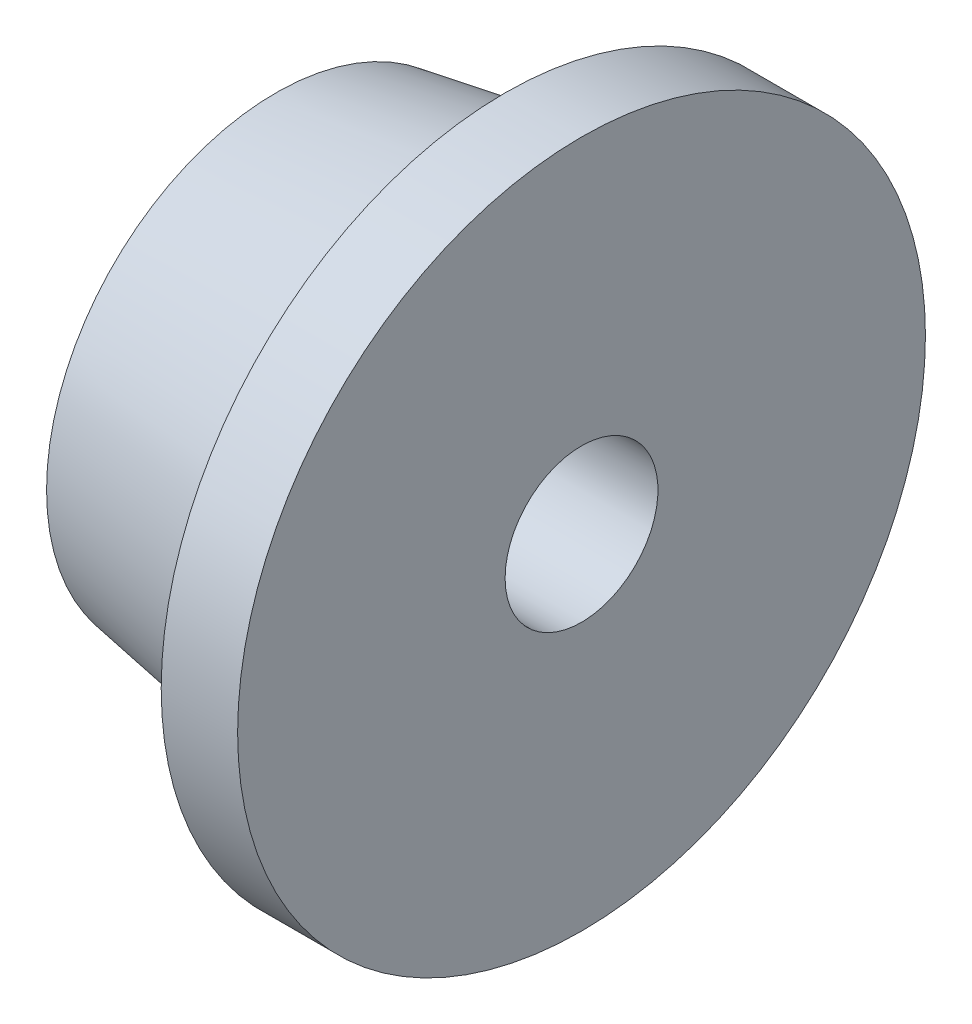
ISO-10303-21;
HEADER;
FILE_DESCRIPTION(('STEP AP214'),'2;1');
FILE_NAME('part.step','',(''),(''),'','','');
FILE_SCHEMA(('AUTOMOTIVE_DESIGN { 1 0 10303 214 1 1 1 1 }'));
ENDSEC;
DATA;
#1=APPLICATION_CONTEXT('core data for automotive mechanical design processes');
#2=APPLICATION_PROTOCOL_DEFINITION('international standard','automotive_design',2000,#1);
#3=PRODUCT_CONTEXT('',#1,'mechanical');
#4=PRODUCT('Part','Part','',(#3));
#5=PRODUCT_RELATED_PRODUCT_CATEGORY('part','',(#4));
#6=PRODUCT_DEFINITION_FORMATION('','',#4);
#7=PRODUCT_DEFINITION_CONTEXT('part definition',#1,'design');
#8=PRODUCT_DEFINITION('design','',#6,#7);
#9=PRODUCT_DEFINITION_SHAPE('','',#8);
#10=(LENGTH_UNIT() NAMED_UNIT(*) SI_UNIT(.MILLI.,.METRE.));
#11=(NAMED_UNIT(*) PLANE_ANGLE_UNIT() SI_UNIT($,.RADIAN.));
#12=(NAMED_UNIT(*) SI_UNIT($,.STERADIAN.) SOLID_ANGLE_UNIT());
#13=UNCERTAINTY_MEASURE_WITH_UNIT(LENGTH_MEASURE(1.E-05),#10,'distance_accuracy_value','');
#14=(GEOMETRIC_REPRESENTATION_CONTEXT(3) GLOBAL_UNCERTAINTY_ASSIGNED_CONTEXT((#13)) GLOBAL_UNIT_ASSIGNED_CONTEXT((#10,
#11,#12)) REPRESENTATION_CONTEXT('',''));
#15=CARTESIAN_POINT('',(0.,0.,0.));
#16=DIRECTION('',(0.,0.,1.));
#17=DIRECTION('',(1.,0.,0.));
#18=AXIS2_PLACEMENT_3D('',#15,#16,#17);
#19=CARTESIAN_POINT('',(0.927471422705227,4.5,0.));
#20=DIRECTION('',(1.,0.,0.));
#21=DIRECTION('',(0.,0.,-1.));
#22=AXIS2_PLACEMENT_3D('',#19,#20,#21);
#23=PLANE('',#22);
#24=CARTESIAN_POINT('',(0.927471422705228,0.,0.));
#25=DIRECTION('',(-1.,0.,0.));
#26=DIRECTION('',(0.,0.,1.));
#27=AXIS2_PLACEMENT_3D('',#24,#25,#26);
#28=CIRCLE('',#27,3.5);
#29=CARTESIAN_POINT('',(0.927471422705228,0.,3.5));
#30=VERTEX_POINT('',#29);
#31=EDGE_CURVE('E10',#30,#30,#28,.T.);
#32=ORIENTED_EDGE('',*,*,#31,.F.);
#33=EDGE_LOOP('',(#32));
#34=FACE_BOUND('',#33,.T.);
#35=CARTESIAN_POINT('',(0.927471422705226,0.,0.));
#36=DIRECTION('',(-1.,0.,0.));
#37=DIRECTION('',(0.,0.,1.));
#38=AXIS2_PLACEMENT_3D('',#35,#36,#37);
#39=CIRCLE('',#38,4.5);
#40=CARTESIAN_POINT('',(0.927471422705226,0.,4.5));
#41=VERTEX_POINT('',#40);
#42=EDGE_CURVE('E56',#41,#41,#39,.T.);
#43=ORIENTED_EDGE('',*,*,#42,.T.);
#44=EDGE_LOOP('',(#43));
#45=FACE_BOUND('',#44,.T.);
#46=ADVANCED_FACE('F34',(#34,#45),#23,.F.);
#47=CARTESIAN_POINT('',(0.927471422705228,0.,0.));
#48=DIRECTION('',(1.,0.,0.));
#49=DIRECTION('',(0.,0.,-1.));
#50=AXIS2_PLACEMENT_3D('',#47,#48,#49);
#51=CONICAL_SURFACE('',#50,3.5,0.165148677414627);
#52=CARTESIAN_POINT('',(-2.07252857729477,0.,0.));
#53=DIRECTION('',(-1.,0.,0.));
#54=DIRECTION('',(0.,0.,1.));
#55=AXIS2_PLACEMENT_3D('',#52,#53,#54);
#56=CIRCLE('',#55,3.);
#57=CARTESIAN_POINT('',(-2.07252857729477,0.,3.));
#58=VERTEX_POINT('',#57);
#59=EDGE_CURVE('E40',#58,#58,#56,.T.);
#60=ORIENTED_EDGE('',*,*,#59,.F.);
#61=EDGE_LOOP('',(#60));
#62=FACE_BOUND('',#61,.T.);
#63=ORIENTED_EDGE('',*,*,#31,.T.);
#64=EDGE_LOOP('',(#63));
#65=FACE_BOUND('',#64,.T.);
#66=ADVANCED_FACE('F81',(#62,#65),#51,.T.);
#67=CARTESIAN_POINT('',(-2.07252857729477,1.,0.));
#68=DIRECTION('',(1.,0.,0.));
#69=DIRECTION('',(0.,0.,-1.));
#70=AXIS2_PLACEMENT_3D('',#67,#68,#69);
#71=PLANE('',#70);
#72=CARTESIAN_POINT('',(-2.07252857729477,0.,0.));
#73=DIRECTION('',(-1.,0.,0.));
#74=DIRECTION('',(0.,0.,1.));
#75=AXIS2_PLACEMENT_3D('',#72,#73,#74);
#76=CIRCLE('',#75,1.);
#77=CARTESIAN_POINT('',(-2.07252857729477,0.,1.));
#78=VERTEX_POINT('',#77);
#79=EDGE_CURVE('E44',#78,#78,#76,.T.);
#80=ORIENTED_EDGE('',*,*,#79,.F.);
#81=EDGE_LOOP('',(#80));
#82=FACE_BOUND('',#81,.T.);
#83=ORIENTED_EDGE('',*,*,#59,.T.);
#84=EDGE_LOOP('',(#83));
#85=FACE_BOUND('',#84,.T.);
#86=ADVANCED_FACE('F76',(#82,#85),#71,.F.);
#87=CARTESIAN_POINT('',(-11.4711893790993,0.,0.));
#88=DIRECTION('',(-1.,0.,0.));
#89=DIRECTION('',(0.,0.,1.));
#90=AXIS2_PLACEMENT_3D('',#87,#88,#89);
#91=CYLINDRICAL_SURFACE('',#90,1.);
#92=CARTESIAN_POINT('',(1.92747142270523,0.,0.));
#93=DIRECTION('',(-1.,0.,0.));
#94=DIRECTION('',(0.,0.,1.));
#95=AXIS2_PLACEMENT_3D('',#92,#93,#94);
#96=CIRCLE('',#95,1.);
#97=CARTESIAN_POINT('',(1.92747142270523,0.,1.));
#98=VERTEX_POINT('',#97);
#99=EDGE_CURVE('E48',#98,#98,#96,.T.);
#100=ORIENTED_EDGE('',*,*,#99,.F.);
#101=EDGE_LOOP('',(#100));
#102=FACE_BOUND('',#101,.T.);
#103=ORIENTED_EDGE('',*,*,#79,.T.);
#104=EDGE_LOOP('',(#103));
#105=FACE_BOUND('',#104,.T.);
#106=ADVANCED_FACE('F70',(#102,#105),#91,.F.);
#107=CARTESIAN_POINT('',(1.92747142270523,4.5,0.));
#108=DIRECTION('',(-1.,0.,0.));
#109=DIRECTION('',(0.,0.,1.));
#110=AXIS2_PLACEMENT_3D('',#107,#108,#109);
#111=PLANE('',#110);
#112=CARTESIAN_POINT('',(1.92747142270523,0.,0.));
#113=DIRECTION('',(-1.,0.,0.));
#114=DIRECTION('',(0.,0.,1.));
#115=AXIS2_PLACEMENT_3D('',#112,#113,#114);
#116=CIRCLE('',#115,4.5);
#117=CARTESIAN_POINT('',(1.92747142270523,0.,4.5));
#118=VERTEX_POINT('',#117);
#119=EDGE_CURVE('E53',#118,#118,#116,.T.);
#120=ORIENTED_EDGE('',*,*,#119,.F.);
#121=EDGE_LOOP('',(#120));
#122=FACE_BOUND('',#121,.T.);
#123=ORIENTED_EDGE('',*,*,#99,.T.);
#124=EDGE_LOOP('',(#123));
#125=FACE_BOUND('',#124,.T.);
#126=ADVANCED_FACE('F64',(#122,#125),#111,.F.);
#127=CARTESIAN_POINT('',(-11.4711893790993,0.,0.));
#128=DIRECTION('',(-1.,0.,0.));
#129=DIRECTION('',(0.,0.,1.));
#130=AXIS2_PLACEMENT_3D('',#127,#128,#129);
#131=CYLINDRICAL_SURFACE('',#130,4.5);
#132=ORIENTED_EDGE('',*,*,#42,.F.);
#133=EDGE_LOOP('',(#132));
#134=FACE_BOUND('',#133,.T.);
#135=ORIENTED_EDGE('',*,*,#119,.T.);
#136=EDGE_LOOP('',(#135));
#137=FACE_BOUND('',#136,.T.);
#138=ADVANCED_FACE('F61',(#134,#137),#131,.T.);
#139=CLOSED_SHELL('',(#46,#66,#86,#106,#126,#138));
#140=MANIFOLD_SOLID_BREP('B2',#139);
#141=ADVANCED_BREP_SHAPE_REPRESENTATION('',(#18,#140),#14);
#142=SHAPE_DEFINITION_REPRESENTATION(#9,#141);
ENDSEC;
END-ISO-10303-21;
